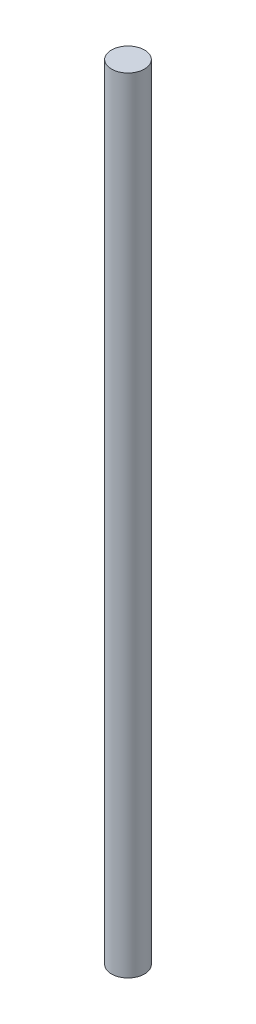
ISO-10303-21;
HEADER;
FILE_DESCRIPTION(('STEP AP214'),'2;1');
FILE_NAME('part.step','',(''),(''),'','','');
FILE_SCHEMA(('AUTOMOTIVE_DESIGN { 1 0 10303 214 1 1 1 1 }'));
ENDSEC;
DATA;
#1=APPLICATION_CONTEXT('core data for automotive mechanical design processes');
#2=APPLICATION_PROTOCOL_DEFINITION('international standard','automotive_design',2000,#1);
#3=PRODUCT_CONTEXT('',#1,'mechanical');
#4=PRODUCT('Part','Part','',(#3));
#5=PRODUCT_RELATED_PRODUCT_CATEGORY('part','',(#4));
#6=PRODUCT_DEFINITION_FORMATION('','',#4);
#7=PRODUCT_DEFINITION_CONTEXT('part definition',#1,'design');
#8=PRODUCT_DEFINITION('design','',#6,#7);
#9=PRODUCT_DEFINITION_SHAPE('','',#8);
#10=(LENGTH_UNIT() NAMED_UNIT(*) SI_UNIT(.MILLI.,.METRE.));
#11=(NAMED_UNIT(*) PLANE_ANGLE_UNIT() SI_UNIT($,.RADIAN.));
#12=(NAMED_UNIT(*) SI_UNIT($,.STERADIAN.) SOLID_ANGLE_UNIT());
#13=UNCERTAINTY_MEASURE_WITH_UNIT(LENGTH_MEASURE(1.E-05),#10,'distance_accuracy_value','');
#14=(GEOMETRIC_REPRESENTATION_CONTEXT(3) GLOBAL_UNCERTAINTY_ASSIGNED_CONTEXT((#13)) GLOBAL_UNIT_ASSIGNED_CONTEXT((#10,
#11,#12)) REPRESENTATION_CONTEXT('',''));
#15=CARTESIAN_POINT('',(0.,0.,0.));
#16=DIRECTION('',(0.,0.,1.));
#17=DIRECTION('',(1.,0.,0.));
#18=AXIS2_PLACEMENT_3D('',#15,#16,#17);
#19=CARTESIAN_POINT('',(0.,69.85,0.));
#20=DIRECTION('',(0.,-1.,0.));
#21=DIRECTION('',(0.,0.,-1.));
#22=AXIS2_PLACEMENT_3D('',#19,#20,#21);
#23=CYLINDRICAL_SURFACE('',#22,1.4732);
#24=CARTESIAN_POINT('',(0.,69.85,0.));
#25=DIRECTION('',(0.,1.,0.));
#26=DIRECTION('',(0.,0.,1.));
#27=AXIS2_PLACEMENT_3D('',#24,#25,#26);
#28=CIRCLE('',#27,1.4732);
#29=CARTESIAN_POINT('',(0.,69.85,1.4732));
#30=VERTEX_POINT('',#29);
#31=EDGE_CURVE('E10',#30,#30,#28,.T.);
#32=ORIENTED_EDGE('',*,*,#31,.F.);
#33=EDGE_LOOP('',(#32));
#34=FACE_BOUND('',#33,.T.);
#35=CARTESIAN_POINT('',(0.,0.,0.));
#36=DIRECTION('',(0.,1.,0.));
#37=DIRECTION('',(0.,0.,1.));
#38=AXIS2_PLACEMENT_3D('',#35,#36,#37);
#39=CIRCLE('',#38,1.4732);
#40=CARTESIAN_POINT('',(0.,0.,1.4732));
#41=VERTEX_POINT('',#40);
#42=EDGE_CURVE('E33',#41,#41,#39,.T.);
#43=ORIENTED_EDGE('',*,*,#42,.T.);
#44=EDGE_LOOP('',(#43));
#45=FACE_BOUND('',#44,.T.);
#46=ADVANCED_FACE('F30',(#34,#45),#23,.T.);
#47=CARTESIAN_POINT('',(0.,69.85,0.));
#48=DIRECTION('',(0.,1.,0.));
#49=DIRECTION('',(0.,0.,1.));
#50=AXIS2_PLACEMENT_3D('',#47,#48,#49);
#51=PLANE('',#50);
#52=ORIENTED_EDGE('',*,*,#31,.T.);
#53=EDGE_LOOP('',(#52));
#54=FACE_BOUND('',#53,.T.);
#55=ADVANCED_FACE('F45',(#54),#51,.T.);
#56=CARTESIAN_POINT('',(0.,0.,0.));
#57=DIRECTION('',(0.,1.,0.));
#58=DIRECTION('',(0.,0.,1.));
#59=AXIS2_PLACEMENT_3D('',#56,#57,#58);
#60=PLANE('',#59);
#61=ORIENTED_EDGE('',*,*,#42,.F.);
#62=EDGE_LOOP('',(#61));
#63=FACE_BOUND('',#62,.T.);
#64=ADVANCED_FACE('F43',(#63),#60,.F.);
#65=CLOSED_SHELL('',(#46,#55,#64));
#66=MANIFOLD_SOLID_BREP('B2',#65);
#67=ADVANCED_BREP_SHAPE_REPRESENTATION('',(#18,#66),#14);
#68=SHAPE_DEFINITION_REPRESENTATION(#9,#67);
ENDSEC;
END-ISO-10303-21;
